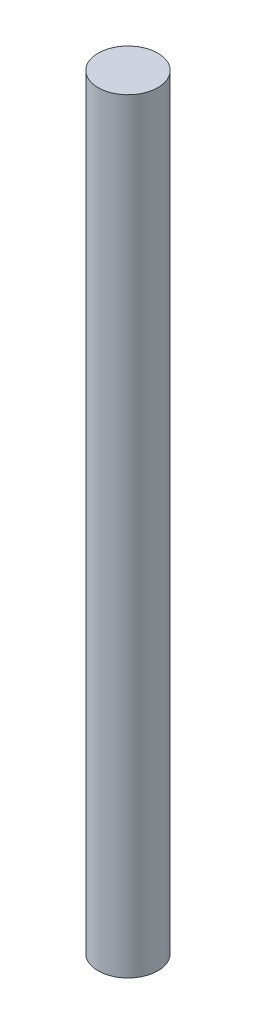
ISO-10303-21;
HEADER;
FILE_DESCRIPTION(('STEP AP214'),'2;1');
FILE_NAME('part.step','',(''),(''),'','','');
FILE_SCHEMA(('AUTOMOTIVE_DESIGN { 1 0 10303 214 1 1 1 1 }'));
ENDSEC;
DATA;
#1=APPLICATION_CONTEXT('core data for automotive mechanical design processes');
#2=APPLICATION_PROTOCOL_DEFINITION('international standard','automotive_design',2000,#1);
#3=PRODUCT_CONTEXT('',#1,'mechanical');
#4=PRODUCT('Part','Part','',(#3));
#5=PRODUCT_RELATED_PRODUCT_CATEGORY('part','',(#4));
#6=PRODUCT_DEFINITION_FORMATION('','',#4);
#7=PRODUCT_DEFINITION_CONTEXT('part definition',#1,'design');
#8=PRODUCT_DEFINITION('design','',#6,#7);
#9=PRODUCT_DEFINITION_SHAPE('','',#8);
#10=(LENGTH_UNIT() NAMED_UNIT(*) SI_UNIT(.MILLI.,.METRE.));
#11=(NAMED_UNIT(*) PLANE_ANGLE_UNIT() SI_UNIT($,.RADIAN.));
#12=(NAMED_UNIT(*) SI_UNIT($,.STERADIAN.) SOLID_ANGLE_UNIT());
#13=UNCERTAINTY_MEASURE_WITH_UNIT(LENGTH_MEASURE(1.E-05),#10,'distance_accuracy_value','');
#14=(GEOMETRIC_REPRESENTATION_CONTEXT(3) GLOBAL_UNCERTAINTY_ASSIGNED_CONTEXT((#13)) GLOBAL_UNIT_ASSIGNED_CONTEXT((#10,
#11,#12)) REPRESENTATION_CONTEXT('',''));
#15=CARTESIAN_POINT('',(0.,0.,0.));
#16=DIRECTION('',(0.,0.,1.));
#17=DIRECTION('',(1.,0.,0.));
#18=AXIS2_PLACEMENT_3D('',#15,#16,#17);
#19=CARTESIAN_POINT('',(0.,101.6,0.));
#20=DIRECTION('',(0.,-1.,0.));
#21=DIRECTION('',(0.,0.,-1.));
#22=AXIS2_PLACEMENT_3D('',#19,#20,#21);
#23=CYLINDRICAL_SURFACE('',#22,3.96875);
#24=CARTESIAN_POINT('',(0.,101.6,0.));
#25=DIRECTION('',(0.,1.,0.));
#26=DIRECTION('',(0.,0.,1.));
#27=AXIS2_PLACEMENT_3D('',#24,#25,#26);
#28=CIRCLE('',#27,3.96875);
#29=CARTESIAN_POINT('',(0.,101.6,3.96875));
#30=VERTEX_POINT('',#29);
#31=EDGE_CURVE('E10',#30,#30,#28,.T.);
#32=ORIENTED_EDGE('',*,*,#31,.F.);
#33=EDGE_LOOP('',(#32));
#34=FACE_BOUND('',#33,.T.);
#35=CARTESIAN_POINT('',(0.,0.,0.));
#36=DIRECTION('',(0.,1.,0.));
#37=DIRECTION('',(0.,0.,1.));
#38=AXIS2_PLACEMENT_3D('',#35,#36,#37);
#39=CIRCLE('',#38,3.96875);
#40=CARTESIAN_POINT('',(0.,0.,3.96875));
#41=VERTEX_POINT('',#40);
#42=EDGE_CURVE('E34',#41,#41,#39,.T.);
#43=ORIENTED_EDGE('',*,*,#42,.T.);
#44=EDGE_LOOP('',(#43));
#45=FACE_BOUND('',#44,.T.);
#46=ADVANCED_FACE('F31',(#34,#45),#23,.T.);
#47=CARTESIAN_POINT('',(0.,101.6,0.));
#48=DIRECTION('',(0.,1.,0.));
#49=DIRECTION('',(0.,0.,1.));
#50=AXIS2_PLACEMENT_3D('',#47,#48,#49);
#51=PLANE('',#50);
#52=ORIENTED_EDGE('',*,*,#31,.T.);
#53=EDGE_LOOP('',(#52));
#54=FACE_BOUND('',#53,.T.);
#55=ADVANCED_FACE('F46',(#54),#51,.T.);
#56=CARTESIAN_POINT('',(0.,0.,0.));
#57=DIRECTION('',(0.,1.,0.));
#58=DIRECTION('',(0.,0.,1.));
#59=AXIS2_PLACEMENT_3D('',#56,#57,#58);
#60=PLANE('',#59);
#61=ORIENTED_EDGE('',*,*,#42,.F.);
#62=EDGE_LOOP('',(#61));
#63=FACE_BOUND('',#62,.T.);
#64=ADVANCED_FACE('F44',(#63),#60,.F.);
#65=CLOSED_SHELL('',(#46,#55,#64));
#66=MANIFOLD_SOLID_BREP('B2',#65);
#67=ADVANCED_BREP_SHAPE_REPRESENTATION('',(#18,#66),#14);
#68=SHAPE_DEFINITION_REPRESENTATION(#9,#67);
ENDSEC;
END-ISO-10303-21;
